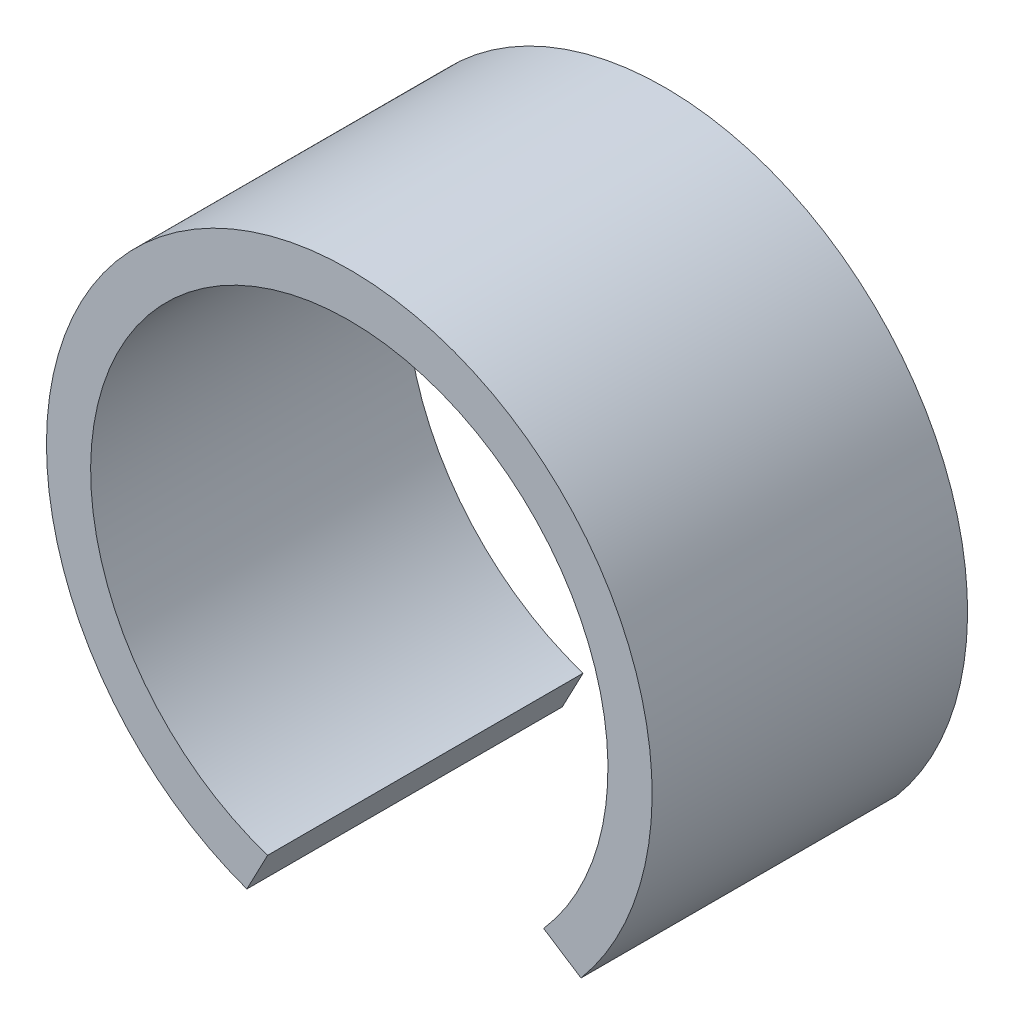
ISO-10303-21;
HEADER;
FILE_DESCRIPTION(('STEP AP214'),'2;1');
FILE_NAME('part.step','',(''),(''),'','','');
FILE_SCHEMA(('AUTOMOTIVE_DESIGN { 1 0 10303 214 1 1 1 1 }'));
ENDSEC;
DATA;
#1=APPLICATION_CONTEXT('core data for automotive mechanical design processes');
#2=APPLICATION_PROTOCOL_DEFINITION('international standard','automotive_design',2000,#1);
#3=PRODUCT_CONTEXT('',#1,'mechanical');
#4=PRODUCT('Part','Part','',(#3));
#5=PRODUCT_RELATED_PRODUCT_CATEGORY('part','',(#4));
#6=PRODUCT_DEFINITION_FORMATION('','',#4);
#7=PRODUCT_DEFINITION_CONTEXT('part definition',#1,'design');
#8=PRODUCT_DEFINITION('design','',#6,#7);
#9=PRODUCT_DEFINITION_SHAPE('','',#8);
#10=(LENGTH_UNIT() NAMED_UNIT(*) SI_UNIT(.MILLI.,.METRE.));
#11=(NAMED_UNIT(*) PLANE_ANGLE_UNIT() SI_UNIT($,.RADIAN.));
#12=(NAMED_UNIT(*) SI_UNIT($,.STERADIAN.) SOLID_ANGLE_UNIT());
#13=UNCERTAINTY_MEASURE_WITH_UNIT(LENGTH_MEASURE(1.E-05),#10,'distance_accuracy_value','');
#14=(GEOMETRIC_REPRESENTATION_CONTEXT(3) GLOBAL_UNCERTAINTY_ASSIGNED_CONTEXT((#13)) GLOBAL_UNIT_ASSIGNED_CONTEXT((#10,
#11,#12)) REPRESENTATION_CONTEXT('',''));
#15=CARTESIAN_POINT('',(0.,0.,0.));
#16=DIRECTION('',(0.,0.,1.));
#17=DIRECTION('',(1.,0.,0.));
#18=AXIS2_PLACEMENT_3D('',#15,#16,#17);
#19=CARTESIAN_POINT('',(0.,0.,25.));
#20=DIRECTION('',(0.,0.,-1.));
#21=DIRECTION('',(-1.,0.,0.));
#22=AXIS2_PLACEMENT_3D('',#19,#20,#21);
#23=CYLINDRICAL_SURFACE('',#22,20.5);
#24=CARTESIAN_POINT('',(0.,0.,0.));
#25=DIRECTION('',(0.,0.,1.));
#26=DIRECTION('',(1.,0.,0.));
#27=AXIS2_PLACEMENT_3D('',#24,#25,#26);
#28=CIRCLE('',#27,20.5);
#29=CARTESIAN_POINT('',(15.4001317763262,-13.5309253664259,0.));
#30=VERTEX_POINT('',#29);
#31=CARTESIAN_POINT('',(-6.47319249846514,-19.4511639466078,0.));
#32=VERTEX_POINT('',#31);
#33=EDGE_CURVE('E98',#30,#32,#28,.T.);
#34=ORIENTED_EDGE('',*,*,#33,.F.);
#35=DIRECTION('',(0.,0.,-1.));
#36=VECTOR('',#35,1.);
#37=CARTESIAN_POINT('',(15.4001317763262,-13.5309253664259,25.));
#38=LINE('',#37,#36);
#39=CARTESIAN_POINT('',(15.4001317763262,-13.5309253664259,25.));
#40=VERTEX_POINT('',#39);
#41=EDGE_CURVE('E11',#40,#30,#38,.T.);
#42=ORIENTED_EDGE('',*,*,#41,.F.);
#43=CARTESIAN_POINT('',(0.,0.,25.));
#44=DIRECTION('',(0.,0.,1.));
#45=DIRECTION('',(1.,0.,0.));
#46=AXIS2_PLACEMENT_3D('',#43,#44,#45);
#47=CIRCLE('',#46,20.5);
#48=CARTESIAN_POINT('',(-6.47319249846514,-19.4511639466078,25.));
#49=VERTEX_POINT('',#48);
#50=EDGE_CURVE('E83',#40,#49,#47,.T.);
#51=ORIENTED_EDGE('',*,*,#50,.T.);
#52=DIRECTION('',(0.,0.,-1.));
#53=VECTOR('',#52,1.);
#54=CARTESIAN_POINT('',(-6.47319249846514,-19.4511639466078,25.));
#55=LINE('',#54,#53);
#56=EDGE_CURVE('E51',#49,#32,#55,.T.);
#57=ORIENTED_EDGE('',*,*,#56,.T.);
#58=EDGE_LOOP('',(#34,#42,#51,#57));
#59=FACE_BOUND('',#58,.T.);
#60=ADVANCED_FACE('F35',(#59),#23,.F.);
#61=CARTESIAN_POINT('',(-1.61969451611096,-2.49878177096681,25.));
#62=DIRECTION('',(0.543922350365824,0.839135553276417,0.));
#63=DIRECTION('',(-0.839135553276417,0.543922350365824,0.));
#64=AXIS2_PLACEMENT_3D('',#61,#62,#63);
#65=PLANE('',#64);
#66=DIRECTION('',(0.839135553276417,-0.543922350365824,0.));
#67=VECTOR('',#66,1.);
#68=CARTESIAN_POINT('',(-1.61969451611096,-2.49878177096681,0.));
#69=LINE('',#68,#67);
#70=CARTESIAN_POINT('',(18.3639390944728,-15.4520464966454,0.));
#71=VERTEX_POINT('',#70);
#72=EDGE_CURVE('E89',#30,#71,#69,.T.);
#73=ORIENTED_EDGE('',*,*,#72,.T.);
#74=DIRECTION('',(0.,0.,-1.));
#75=VECTOR('',#74,1.);
#76=CARTESIAN_POINT('',(18.3639390944728,-15.4520464966454,25.));
#77=LINE('',#76,#75);
#78=CARTESIAN_POINT('',(18.3639390944728,-15.4520464966454,25.));
#79=VERTEX_POINT('',#78);
#80=EDGE_CURVE('E43',#79,#71,#77,.T.);
#81=ORIENTED_EDGE('',*,*,#80,.F.);
#82=DIRECTION('',(0.839135553276417,-0.543922350365824,0.));
#83=VECTOR('',#82,1.);
#84=CARTESIAN_POINT('',(-1.61969451611096,-2.49878177096681,25.));
#85=LINE('',#84,#83);
#86=EDGE_CURVE('E77',#40,#79,#85,.T.);
#87=ORIENTED_EDGE('',*,*,#86,.F.);
#88=ORIENTED_EDGE('',*,*,#41,.T.);
#89=EDGE_LOOP('',(#73,#81,#87,#88));
#90=FACE_BOUND('',#89,.T.);
#91=ADVANCED_FACE('F87',(#90),#65,.F.);
#92=CARTESIAN_POINT('',(0.,0.,25.));
#93=DIRECTION('',(0.,0.,-1.));
#94=DIRECTION('',(-1.,0.,0.));
#95=AXIS2_PLACEMENT_3D('',#92,#93,#94);
#96=CYLINDRICAL_SURFACE('',#95,24.);
#97=CARTESIAN_POINT('',(0.,0.,0.));
#98=DIRECTION('',(0.,0.,1.));
#99=DIRECTION('',(1.,0.,0.));
#100=AXIS2_PLACEMENT_3D('',#97,#98,#99);
#101=CIRCLE('',#100,24.);
#102=CARTESIAN_POINT('',(-8.11744196705853,-22.5855514856609,0.));
#103=VERTEX_POINT('',#102);
#104=EDGE_CURVE('E101',#71,#103,#101,.T.);
#105=ORIENTED_EDGE('',*,*,#104,.T.);
#106=DIRECTION('',(0.,0.,-1.));
#107=VECTOR('',#106,1.);
#108=CARTESIAN_POINT('',(-8.11744196705853,-22.5855514856609,25.));
#109=LINE('',#108,#107);
#110=CARTESIAN_POINT('',(-8.11744196705853,-22.5855514856609,25.));
#111=VERTEX_POINT('',#110);
#112=EDGE_CURVE('E65',#111,#103,#109,.T.);
#113=ORIENTED_EDGE('',*,*,#112,.F.);
#114=CARTESIAN_POINT('',(0.,0.,25.));
#115=DIRECTION('',(0.,0.,1.));
#116=DIRECTION('',(1.,0.,0.));
#117=AXIS2_PLACEMENT_3D('',#114,#115,#116);
#118=CIRCLE('',#117,24.);
#119=EDGE_CURVE('E82',#79,#111,#118,.T.);
#120=ORIENTED_EDGE('',*,*,#119,.F.);
#121=ORIENTED_EDGE('',*,*,#80,.T.);
#122=EDGE_LOOP('',(#105,#113,#120,#121));
#123=FACE_BOUND('',#122,.T.);
#124=ADVANCED_FACE('F92',(#123),#96,.T.);
#125=CARTESIAN_POINT('',(2.92551008783715,-1.53467570533542,25.));
#126=DIRECTION('',(0.885549480619951,-0.464545064954666,0.));
#127=DIRECTION('',(0.464545064954666,0.885549480619951,0.));
#128=AXIS2_PLACEMENT_3D('',#125,#126,#127);
#129=PLANE('',#128);
#130=DIRECTION('',(-0.464545064954666,-0.885549480619951,0.));
#131=VECTOR('',#130,1.);
#132=CARTESIAN_POINT('',(2.92551008783715,-1.53467570533542,0.));
#133=LINE('',#132,#131);
#134=EDGE_CURVE('E103',#32,#103,#133,.T.);
#135=ORIENTED_EDGE('',*,*,#134,.F.);
#136=ORIENTED_EDGE('',*,*,#56,.F.);
#137=DIRECTION('',(-0.464545064954666,-0.885549480619951,0.));
#138=VECTOR('',#137,1.);
#139=CARTESIAN_POINT('',(2.92551008783715,-1.53467570533542,25.));
#140=LINE('',#139,#138);
#141=EDGE_CURVE('E93',#49,#111,#140,.T.);
#142=ORIENTED_EDGE('',*,*,#141,.T.);
#143=ORIENTED_EDGE('',*,*,#112,.T.);
#144=EDGE_LOOP('',(#135,#136,#142,#143));
#145=FACE_BOUND('',#144,.T.);
#146=ADVANCED_FACE('F108',(#145),#129,.T.);
#147=CARTESIAN_POINT('',(0.,0.,25.));
#148=DIRECTION('',(0.,0.,1.));
#149=DIRECTION('',(1.,0.,0.));
#150=AXIS2_PLACEMENT_3D('',#147,#148,#149);
#151=PLANE('',#150);
#152=ORIENTED_EDGE('',*,*,#50,.F.);
#153=ORIENTED_EDGE('',*,*,#86,.T.);
#154=ORIENTED_EDGE('',*,*,#119,.T.);
#155=ORIENTED_EDGE('',*,*,#141,.F.);
#156=EDGE_LOOP('',(#152,#153,#154,#155));
#157=FACE_BOUND('',#156,.T.);
#158=ADVANCED_FACE('F79',(#157),#151,.T.);
#159=CARTESIAN_POINT('',(0.,0.,0.));
#160=DIRECTION('',(0.,0.,1.));
#161=DIRECTION('',(1.,0.,0.));
#162=AXIS2_PLACEMENT_3D('',#159,#160,#161);
#163=PLANE('',#162);
#164=ORIENTED_EDGE('',*,*,#33,.T.);
#165=ORIENTED_EDGE('',*,*,#134,.T.);
#166=ORIENTED_EDGE('',*,*,#104,.F.);
#167=ORIENTED_EDGE('',*,*,#72,.F.);
#168=EDGE_LOOP('',(#164,#165,#166,#167));
#169=FACE_BOUND('',#168,.T.);
#170=ADVANCED_FACE('F115',(#169),#163,.F.);
#171=CLOSED_SHELL('',(#60,#91,#124,#146,#158,#170));
#172=MANIFOLD_SOLID_BREP('B2',#171);
#173=ADVANCED_BREP_SHAPE_REPRESENTATION('',(#18,#172),#14);
#174=SHAPE_DEFINITION_REPRESENTATION(#9,#173);
ENDSEC;
END-ISO-10303-21;
